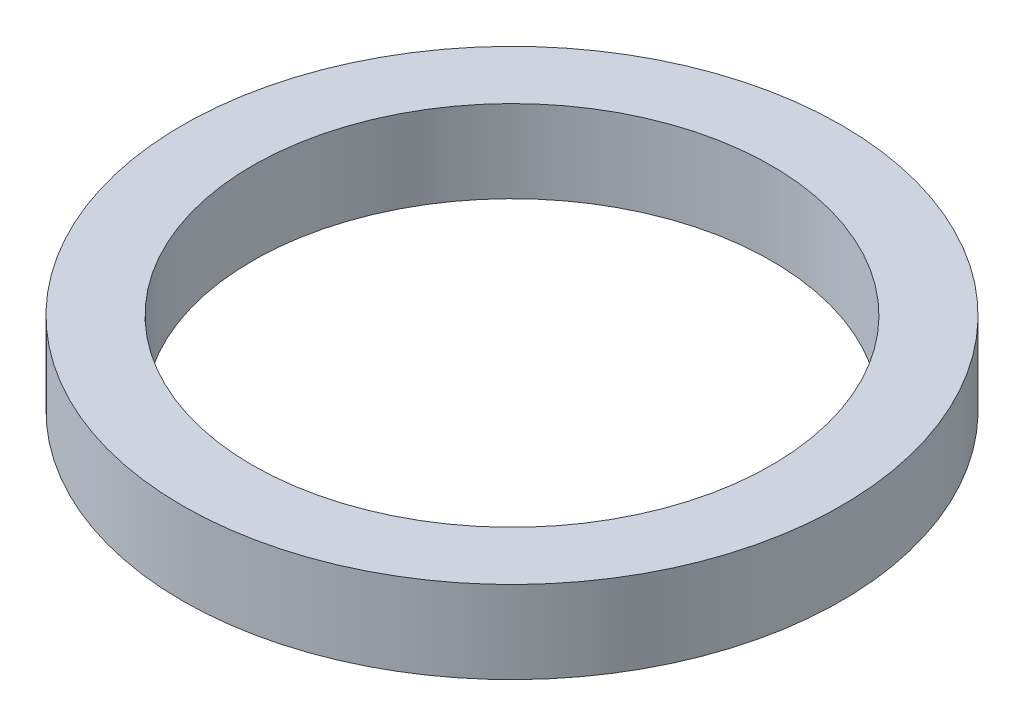
ISO-10303-21;
HEADER;
FILE_DESCRIPTION(('STEP AP214'),'2;1');
FILE_NAME('part.step','',(''),(''),'','','');
FILE_SCHEMA(('AUTOMOTIVE_DESIGN { 1 0 10303 214 1 1 1 1 }'));
ENDSEC;
DATA;
#1=APPLICATION_CONTEXT('core data for automotive mechanical design processes');
#2=APPLICATION_PROTOCOL_DEFINITION('international standard','automotive_design',2000,#1);
#3=PRODUCT_CONTEXT('',#1,'mechanical');
#4=PRODUCT('Part','Part','',(#3));
#5=PRODUCT_RELATED_PRODUCT_CATEGORY('part','',(#4));
#6=PRODUCT_DEFINITION_FORMATION('','',#4);
#7=PRODUCT_DEFINITION_CONTEXT('part definition',#1,'design');
#8=PRODUCT_DEFINITION('design','',#6,#7);
#9=PRODUCT_DEFINITION_SHAPE('','',#8);
#10=(LENGTH_UNIT() NAMED_UNIT(*) SI_UNIT(.MILLI.,.METRE.));
#11=(NAMED_UNIT(*) PLANE_ANGLE_UNIT() SI_UNIT($,.RADIAN.));
#12=(NAMED_UNIT(*) SI_UNIT($,.STERADIAN.) SOLID_ANGLE_UNIT());
#13=UNCERTAINTY_MEASURE_WITH_UNIT(LENGTH_MEASURE(1.E-05),#10,'distance_accuracy_value','');
#14=(GEOMETRIC_REPRESENTATION_CONTEXT(3) GLOBAL_UNCERTAINTY_ASSIGNED_CONTEXT((#13)) GLOBAL_UNIT_ASSIGNED_CONTEXT((#10,
#11,#12)) REPRESENTATION_CONTEXT('',''));
#15=CARTESIAN_POINT('',(0.,0.,0.));
#16=DIRECTION('',(0.,0.,1.));
#17=DIRECTION('',(1.,0.,0.));
#18=AXIS2_PLACEMENT_3D('',#15,#16,#17);
#19=CARTESIAN_POINT('',(0.,1.5875,0.));
#20=DIRECTION('',(0.,1.,0.));
#21=DIRECTION('',(0.,0.,1.));
#22=AXIS2_PLACEMENT_3D('',#19,#20,#21);
#23=PLANE('',#22);
#24=CARTESIAN_POINT('',(0.,1.5875,0.));
#25=DIRECTION('',(0.,1.,0.));
#26=DIRECTION('',(0.,0.,1.));
#27=AXIS2_PLACEMENT_3D('',#24,#25,#26);
#28=CIRCLE('',#27,6.35);
#29=CARTESIAN_POINT('',(0.,1.5875,6.35));
#30=VERTEX_POINT('',#29);
#31=EDGE_CURVE('E10',#30,#30,#28,.T.);
#32=ORIENTED_EDGE('',*,*,#31,.T.);
#33=EDGE_LOOP('',(#32));
#34=FACE_BOUND('',#33,.T.);
#35=CARTESIAN_POINT('',(0.,1.5875,0.));
#36=DIRECTION('',(0.,1.,0.));
#37=DIRECTION('',(0.,0.,1.));
#38=AXIS2_PLACEMENT_3D('',#35,#36,#37);
#39=CIRCLE('',#38,5.);
#40=CARTESIAN_POINT('',(0.,1.5875,5.));
#41=VERTEX_POINT('',#40);
#42=EDGE_CURVE('E46',#41,#41,#39,.T.);
#43=ORIENTED_EDGE('',*,*,#42,.F.);
#44=EDGE_LOOP('',(#43));
#45=FACE_BOUND('',#44,.T.);
#46=ADVANCED_FACE('F35',(#34,#45),#23,.T.);
#47=CARTESIAN_POINT('',(0.,0.,0.));
#48=DIRECTION('',(0.,1.,0.));
#49=DIRECTION('',(0.,0.,1.));
#50=AXIS2_PLACEMENT_3D('',#47,#48,#49);
#51=PLANE('',#50);
#52=CARTESIAN_POINT('',(0.,0.,0.));
#53=DIRECTION('',(0.,1.,0.));
#54=DIRECTION('',(0.,0.,1.));
#55=AXIS2_PLACEMENT_3D('',#52,#53,#54);
#56=CIRCLE('',#55,6.35);
#57=CARTESIAN_POINT('',(0.,0.,6.35));
#58=VERTEX_POINT('',#57);
#59=EDGE_CURVE('E39',#58,#58,#56,.T.);
#60=ORIENTED_EDGE('',*,*,#59,.F.);
#61=EDGE_LOOP('',(#60));
#62=FACE_BOUND('',#61,.T.);
#63=CARTESIAN_POINT('',(0.,0.,0.));
#64=DIRECTION('',(0.,1.,0.));
#65=DIRECTION('',(0.,0.,1.));
#66=AXIS2_PLACEMENT_3D('',#63,#64,#65);
#67=CIRCLE('',#66,5.);
#68=CARTESIAN_POINT('',(0.,0.,5.));
#69=VERTEX_POINT('',#68);
#70=EDGE_CURVE('E48',#69,#69,#67,.T.);
#71=ORIENTED_EDGE('',*,*,#70,.T.);
#72=EDGE_LOOP('',(#71));
#73=FACE_BOUND('',#72,.T.);
#74=ADVANCED_FACE('F58',(#62,#73),#51,.F.);
#75=CARTESIAN_POINT('',(0.,1.5875,0.));
#76=DIRECTION('',(0.,-1.,0.));
#77=DIRECTION('',(0.,0.,-1.));
#78=AXIS2_PLACEMENT_3D('',#75,#76,#77);
#79=CYLINDRICAL_SURFACE('',#78,6.35);
#80=ORIENTED_EDGE('',*,*,#31,.F.);
#81=EDGE_LOOP('',(#80));
#82=FACE_BOUND('',#81,.T.);
#83=ORIENTED_EDGE('',*,*,#59,.T.);
#84=EDGE_LOOP('',(#83));
#85=FACE_BOUND('',#84,.T.);
#86=ADVANCED_FACE('F37',(#82,#85),#79,.T.);
#87=CARTESIAN_POINT('',(0.,1.5875,0.));
#88=DIRECTION('',(0.,-1.,0.));
#89=DIRECTION('',(0.,0.,-1.));
#90=AXIS2_PLACEMENT_3D('',#87,#88,#89);
#91=CYLINDRICAL_SURFACE('',#90,5.);
#92=ORIENTED_EDGE('',*,*,#42,.T.);
#93=EDGE_LOOP('',(#92));
#94=FACE_BOUND('',#93,.T.);
#95=ORIENTED_EDGE('',*,*,#70,.F.);
#96=EDGE_LOOP('',(#95));
#97=FACE_BOUND('',#96,.T.);
#98=ADVANCED_FACE('F54',(#94,#97),#91,.F.);
#99=CLOSED_SHELL('',(#46,#74,#86,#98));
#100=MANIFOLD_SOLID_BREP('B2',#99);
#101=ADVANCED_BREP_SHAPE_REPRESENTATION('',(#18,#100),#14);
#102=SHAPE_DEFINITION_REPRESENTATION(#9,#101);
ENDSEC;
END-ISO-10303-21;
